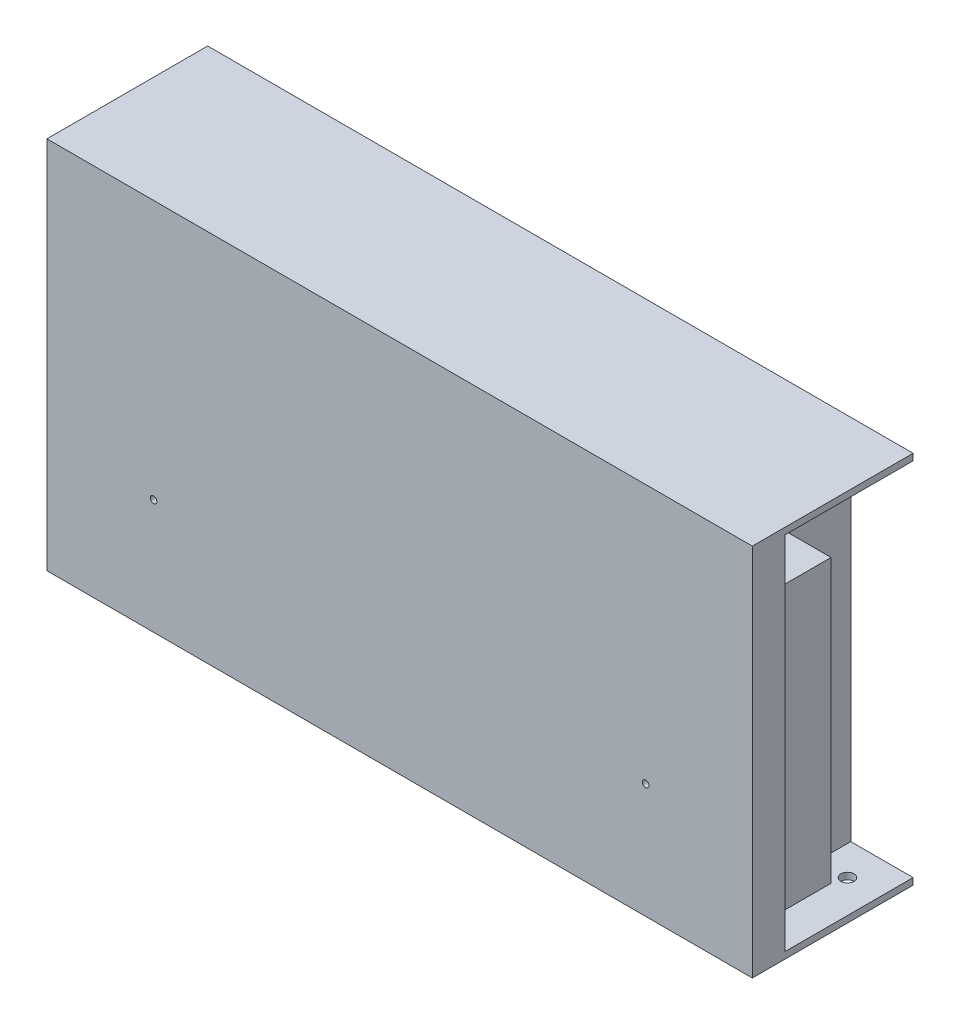
ISO-10303-21;
HEADER;
FILE_DESCRIPTION(('STEP AP214'),'2;1');
FILE_NAME('part.step','',(''),(''),'','','');
FILE_SCHEMA(('AUTOMOTIVE_DESIGN { 1 0 10303 214 1 1 1 1 }'));
ENDSEC;
DATA;
#1=APPLICATION_CONTEXT('core data for automotive mechanical design processes');
#2=APPLICATION_PROTOCOL_DEFINITION('international standard','automotive_design',2000,#1);
#3=PRODUCT_CONTEXT('',#1,'mechanical');
#4=PRODUCT('Part','Part','',(#3));
#5=PRODUCT_RELATED_PRODUCT_CATEGORY('part','',(#4));
#6=PRODUCT_DEFINITION_FORMATION('','',#4);
#7=PRODUCT_DEFINITION_CONTEXT('part definition',#1,'design');
#8=PRODUCT_DEFINITION('design','',#6,#7);
#9=PRODUCT_DEFINITION_SHAPE('','',#8);
#10=(LENGTH_UNIT() NAMED_UNIT(*) SI_UNIT(.MILLI.,.METRE.));
#11=(NAMED_UNIT(*) PLANE_ANGLE_UNIT() SI_UNIT($,.RADIAN.));
#12=(NAMED_UNIT(*) SI_UNIT($,.STERADIAN.) SOLID_ANGLE_UNIT());
#13=UNCERTAINTY_MEASURE_WITH_UNIT(LENGTH_MEASURE(1.E-05),#10,'distance_accuracy_value','');
#14=(GEOMETRIC_REPRESENTATION_CONTEXT(3) GLOBAL_UNCERTAINTY_ASSIGNED_CONTEXT((#13)) GLOBAL_UNIT_ASSIGNED_CONTEXT((#10,
#11,#12)) REPRESENTATION_CONTEXT('',''));
#15=CARTESIAN_POINT('',(0.,0.,0.));
#16=DIRECTION('',(0.,0.,1.));
#17=DIRECTION('',(1.,0.,0.));
#18=AXIS2_PLACEMENT_3D('',#15,#16,#17);
#19=CARTESIAN_POINT('',(88.5,55.,39.));
#20=DIRECTION('',(-1.,0.,0.));
#21=DIRECTION('',(0.,-1.,0.));
#22=AXIS2_PLACEMENT_3D('',#19,#20,#21);
#23=PLANE('',#22);
#24=DIRECTION('',(0.,0.,1.));
#25=VECTOR('',#24,1.);
#26=CARTESIAN_POINT('',(88.5,38.,21.));
#27=LINE('',#26,#25);
#28=CARTESIAN_POINT('',(88.5,38.,21.));
#29=VERTEX_POINT('',#28);
#30=CARTESIAN_POINT('',(88.5,38.,39.));
#31=VERTEX_POINT('',#30);
#32=EDGE_CURVE('E52',#29,#31,#27,.T.);
#33=ORIENTED_EDGE('',*,*,#32,.F.);
#34=DIRECTION('',(0.,1.,0.));
#35=VECTOR('',#34,1.);
#36=CARTESIAN_POINT('',(88.5,38.,21.));
#37=LINE('',#36,#35);
#38=CARTESIAN_POINT('',(88.5,-48.,21.));
#39=VERTEX_POINT('',#38);
#40=EDGE_CURVE('E57',#39,#29,#37,.T.);
#41=ORIENTED_EDGE('',*,*,#40,.F.);
#42=DIRECTION('',(0.,0.,1.));
#43=VECTOR('',#42,1.);
#44=CARTESIAN_POINT('',(88.5,-48.,21.));
#45=LINE('',#44,#43);
#46=CARTESIAN_POINT('',(88.5,-48.,39.));
#47=VERTEX_POINT('',#46);
#48=EDGE_CURVE('E147',#39,#47,#45,.T.);
#49=ORIENTED_EDGE('',*,*,#48,.T.);
#50=DIRECTION('',(0.,1.,0.));
#51=VECTOR('',#50,1.);
#52=CARTESIAN_POINT('',(88.5,55.,39.));
#53=LINE('',#52,#51);
#54=CARTESIAN_POINT('',(88.5,-55.,39.));
#55=VERTEX_POINT('',#54);
#56=EDGE_CURVE('E170',#55,#47,#53,.T.);
#57=ORIENTED_EDGE('',*,*,#56,.F.);
#58=DIRECTION('',(0.,0.,-1.));
#59=VECTOR('',#58,1.);
#60=CARTESIAN_POINT('',(88.5,-55.,39.));
#61=LINE('',#60,#59);
#62=CARTESIAN_POINT('',(88.5,-55.,0.));
#63=VERTEX_POINT('',#62);
#64=EDGE_CURVE('E188',#55,#63,#61,.T.);
#65=ORIENTED_EDGE('',*,*,#64,.T.);
#66=DIRECTION('',(0.,1.,0.));
#67=VECTOR('',#66,1.);
#68=CARTESIAN_POINT('',(88.5,55.,0.));
#69=LINE('',#68,#67);
#70=CARTESIAN_POINT('',(88.5,55.,0.));
#71=VERTEX_POINT('',#70);
#72=EDGE_CURVE('E178',#63,#71,#69,.T.);
#73=ORIENTED_EDGE('',*,*,#72,.T.);
#74=DIRECTION('',(0.,0.,-1.));
#75=VECTOR('',#74,1.);
#76=CARTESIAN_POINT('',(88.5,55.,39.));
#77=LINE('',#76,#75);
#78=CARTESIAN_POINT('',(88.5,55.,39.));
#79=VERTEX_POINT('',#78);
#80=EDGE_CURVE('E186',#79,#71,#77,.T.);
#81=ORIENTED_EDGE('',*,*,#80,.F.);
#82=EDGE_CURVE('E169',#31,#79,#53,.T.);
#83=ORIENTED_EDGE('',*,*,#82,.F.);
#84=EDGE_LOOP('',(#33,#41,#49,#57,#65,#73,#81,#83));
#85=FACE_BOUND('',#84,.T.);
#86=ADVANCED_FACE('F37',(#85),#23,.F.);
#87=CARTESIAN_POINT('',(0.,0.,39.));
#88=DIRECTION('',(0.,0.,1.));
#89=DIRECTION('',(1.,0.,0.));
#90=AXIS2_PLACEMENT_3D('',#87,#88,#89);
#91=PLANE('',#90);
#92=DIRECTION('',(1.,0.,0.));
#93=VECTOR('',#92,1.);
#94=CARTESIAN_POINT('',(103.5,38.,39.));
#95=LINE('',#94,#93);
#96=CARTESIAN_POINT('',(103.5,38.,39.));
#97=VERTEX_POINT('',#96);
#98=EDGE_CURVE('E137',#31,#97,#95,.T.);
#99=ORIENTED_EDGE('',*,*,#98,.F.);
#100=ORIENTED_EDGE('',*,*,#82,.T.);
#101=DIRECTION('',(1.,0.,0.));
#102=VECTOR('',#101,1.);
#103=CARTESIAN_POINT('',(107.5,55.,39.));
#104=LINE('',#103,#102);
#105=CARTESIAN_POINT('',(107.5,55.,39.));
#106=VERTEX_POINT('',#105);
#107=EDGE_CURVE('E172',#79,#106,#104,.T.);
#108=ORIENTED_EDGE('',*,*,#107,.T.);
#109=DIRECTION('',(0.,-1.,0.));
#110=VECTOR('',#109,1.);
#111=CARTESIAN_POINT('',(107.5,-55.,39.));
#112=LINE('',#111,#110);
#113=CARTESIAN_POINT('',(107.5,-55.,39.));
#114=VERTEX_POINT('',#113);
#115=EDGE_CURVE('E162',#106,#114,#112,.T.);
#116=ORIENTED_EDGE('',*,*,#115,.T.);
#117=DIRECTION('',(-1.,0.,0.));
#118=VECTOR('',#117,1.);
#119=CARTESIAN_POINT('',(88.5,-55.,39.));
#120=LINE('',#119,#118);
#121=EDGE_CURVE('E165',#114,#55,#120,.T.);
#122=ORIENTED_EDGE('',*,*,#121,.T.);
#123=ORIENTED_EDGE('',*,*,#56,.T.);
#124=DIRECTION('',(-1.,0.,0.));
#125=VECTOR('',#124,1.);
#126=CARTESIAN_POINT('',(88.5,-48.,39.));
#127=LINE('',#126,#125);
#128=CARTESIAN_POINT('',(103.5,-48.,39.));
#129=VERTEX_POINT('',#128);
#130=EDGE_CURVE('E155',#129,#47,#127,.T.);
#131=ORIENTED_EDGE('',*,*,#130,.F.);
#132=DIRECTION('',(0.,-1.,0.));
#133=VECTOR('',#132,1.);
#134=CARTESIAN_POINT('',(103.5,-48.,39.));
#135=LINE('',#134,#133);
#136=EDGE_CURVE('E152',#97,#129,#135,.T.);
#137=ORIENTED_EDGE('',*,*,#136,.F.);
#138=EDGE_LOOP('',(#99,#100,#108,#116,#122,#123,#131,#137));
#139=FACE_BOUND('',#138,.T.);
#140=ADVANCED_FACE('F248',(#139),#91,.F.);
#141=CARTESIAN_POINT('',(107.5,-57.,49.));
#142=DIRECTION('',(-1.,0.,0.));
#143=DIRECTION('',(0.,0.,1.));
#144=AXIS2_PLACEMENT_3D('',#141,#142,#143);
#145=PLANE('',#144);
#146=ORIENTED_EDGE('',*,*,#115,.F.);
#147=DIRECTION('',(0.,0.,-1.));
#148=VECTOR('',#147,1.);
#149=CARTESIAN_POINT('',(107.5,55.,39.));
#150=LINE('',#149,#148);
#151=CARTESIAN_POINT('',(107.5,55.,0.));
#152=VERTEX_POINT('',#151);
#153=EDGE_CURVE('E182',#106,#152,#150,.T.);
#154=ORIENTED_EDGE('',*,*,#153,.T.);
#155=DIRECTION('',(0.,1.,0.));
#156=VECTOR('',#155,1.);
#157=CARTESIAN_POINT('',(107.5,-57.,0.));
#158=LINE('',#157,#156);
#159=CARTESIAN_POINT('',(107.5,57.,0.));
#160=VERTEX_POINT('',#159);
#161=EDGE_CURVE('E185',#152,#160,#158,.T.);
#162=ORIENTED_EDGE('',*,*,#161,.T.);
#163=DIRECTION('',(0.,0.,-1.));
#164=VECTOR('',#163,1.);
#165=CARTESIAN_POINT('',(107.5,57.,49.));
#166=LINE('',#165,#164);
#167=CARTESIAN_POINT('',(107.5,57.,49.));
#168=VERTEX_POINT('',#167);
#169=EDGE_CURVE('E11',#168,#160,#166,.T.);
#170=ORIENTED_EDGE('',*,*,#169,.F.);
#171=DIRECTION('',(0.,1.,0.));
#172=VECTOR('',#171,1.);
#173=CARTESIAN_POINT('',(107.5,-57.,49.));
#174=LINE('',#173,#172);
#175=CARTESIAN_POINT('',(107.5,-57.,49.));
#176=VERTEX_POINT('',#175);
#177=EDGE_CURVE('E191',#176,#168,#174,.T.);
#178=ORIENTED_EDGE('',*,*,#177,.F.);
#179=DIRECTION('',(0.,0.,-1.));
#180=VECTOR('',#179,1.);
#181=CARTESIAN_POINT('',(107.5,-57.,49.));
#182=LINE('',#181,#180);
#183=CARTESIAN_POINT('',(107.5,-57.,0.));
#184=VERTEX_POINT('',#183);
#185=EDGE_CURVE('E201',#176,#184,#182,.T.);
#186=ORIENTED_EDGE('',*,*,#185,.T.);
#187=CARTESIAN_POINT('',(107.5,-55.,0.));
#188=VERTEX_POINT('',#187);
#189=EDGE_CURVE('E202',#184,#188,#158,.T.);
#190=ORIENTED_EDGE('',*,*,#189,.T.);
#191=DIRECTION('',(0.,0.,-1.));
#192=VECTOR('',#191,1.);
#193=CARTESIAN_POINT('',(107.5,-55.,39.));
#194=LINE('',#193,#192);
#195=EDGE_CURVE('E175',#114,#188,#194,.T.);
#196=ORIENTED_EDGE('',*,*,#195,.F.);
#197=EDGE_LOOP('',(#146,#154,#162,#170,#178,#186,#190,#196));
#198=FACE_BOUND('',#197,.T.);
#199=ADVANCED_FACE('F39',(#198),#145,.F.);
#200=CARTESIAN_POINT('',(-107.5,57.,49.));
#201=DIRECTION('',(0.,-1.,0.));
#202=DIRECTION('',(0.,0.,-1.));
#203=AXIS2_PLACEMENT_3D('',#200,#201,#202);
#204=PLANE('',#203);
#205=DIRECTION('',(-1.,0.,0.));
#206=VECTOR('',#205,1.);
#207=CARTESIAN_POINT('',(-107.5,57.,0.));
#208=LINE('',#207,#206);
#209=CARTESIAN_POINT('',(-107.5,57.,0.));
#210=VERTEX_POINT('',#209);
#211=EDGE_CURVE('E205',#160,#210,#208,.T.);
#212=ORIENTED_EDGE('',*,*,#211,.T.);
#213=DIRECTION('',(0.,0.,-1.));
#214=VECTOR('',#213,1.);
#215=CARTESIAN_POINT('',(-107.5,57.,49.));
#216=LINE('',#215,#214);
#217=CARTESIAN_POINT('',(-107.5,57.,49.));
#218=VERTEX_POINT('',#217);
#219=EDGE_CURVE('E45',#218,#210,#216,.T.);
#220=ORIENTED_EDGE('',*,*,#219,.F.);
#221=DIRECTION('',(-1.,0.,0.));
#222=VECTOR('',#221,1.);
#223=CARTESIAN_POINT('',(-107.5,57.,49.));
#224=LINE('',#223,#222);
#225=EDGE_CURVE('E194',#168,#218,#224,.T.);
#226=ORIENTED_EDGE('',*,*,#225,.F.);
#227=ORIENTED_EDGE('',*,*,#169,.T.);
#228=EDGE_LOOP('',(#212,#220,#226,#227));
#229=FACE_BOUND('',#228,.T.);
#230=ADVANCED_FACE('F241',(#229),#204,.F.);
#231=CARTESIAN_POINT('',(-107.5,-57.,49.));
#232=DIRECTION('',(1.,0.,0.));
#233=DIRECTION('',(0.,0.,-1.));
#234=AXIS2_PLACEMENT_3D('',#231,#232,#233);
#235=PLANE('',#234);
#236=DIRECTION('',(0.,-1.,0.));
#237=VECTOR('',#236,1.);
#238=CARTESIAN_POINT('',(-107.5,-57.,0.));
#239=LINE('',#238,#237);
#240=CARTESIAN_POINT('',(-107.5,-57.,0.));
#241=VERTEX_POINT('',#240);
#242=EDGE_CURVE('E207',#210,#241,#239,.T.);
#243=ORIENTED_EDGE('',*,*,#242,.T.);
#244=DIRECTION('',(0.,0.,-1.));
#245=VECTOR('',#244,1.);
#246=CARTESIAN_POINT('',(-107.5,-57.,49.));
#247=LINE('',#246,#245);
#248=CARTESIAN_POINT('',(-107.5,-57.,49.));
#249=VERTEX_POINT('',#248);
#250=EDGE_CURVE('E212',#249,#241,#247,.T.);
#251=ORIENTED_EDGE('',*,*,#250,.F.);
#252=DIRECTION('',(0.,-1.,0.));
#253=VECTOR('',#252,1.);
#254=CARTESIAN_POINT('',(-107.5,-57.,49.));
#255=LINE('',#254,#253);
#256=EDGE_CURVE('E197',#218,#249,#255,.T.);
#257=ORIENTED_EDGE('',*,*,#256,.F.);
#258=ORIENTED_EDGE('',*,*,#219,.T.);
#259=EDGE_LOOP('',(#243,#251,#257,#258));
#260=FACE_BOUND('',#259,.T.);
#261=ADVANCED_FACE('F219',(#260),#235,.F.);
#262=CARTESIAN_POINT('',(-107.5,-57.,49.));
#263=DIRECTION('',(0.,1.,0.));
#264=DIRECTION('',(0.,0.,1.));
#265=AXIS2_PLACEMENT_3D('',#262,#263,#264);
#266=PLANE('',#265);
#267=CARTESIAN_POINT('',(97.5,-57.,10.));
#268=DIRECTION('',(0.,1.,0.));
#269=DIRECTION('',(0.,0.,1.));
#270=AXIS2_PLACEMENT_3D('',#267,#268,#269);
#271=CIRCLE('',#270,2.);
#272=CARTESIAN_POINT('',(97.5,-57.,12.));
#273=VERTEX_POINT('',#272);
#274=EDGE_CURVE('E153',#273,#273,#271,.T.);
#275=ORIENTED_EDGE('',*,*,#274,.T.);
#276=EDGE_LOOP('',(#275));
#277=FACE_BOUND('',#276,.T.);
#278=DIRECTION('',(1.,0.,0.));
#279=VECTOR('',#278,1.);
#280=CARTESIAN_POINT('',(-107.5,-57.,0.));
#281=LINE('',#280,#279);
#282=EDGE_CURVE('E195',#241,#184,#281,.T.);
#283=ORIENTED_EDGE('',*,*,#282,.T.);
#284=ORIENTED_EDGE('',*,*,#185,.F.);
#285=DIRECTION('',(1.,0.,0.));
#286=VECTOR('',#285,1.);
#287=CARTESIAN_POINT('',(-107.5,-57.,49.));
#288=LINE('',#287,#286);
#289=EDGE_CURVE('E199',#249,#176,#288,.T.);
#290=ORIENTED_EDGE('',*,*,#289,.F.);
#291=ORIENTED_EDGE('',*,*,#250,.T.);
#292=EDGE_LOOP('',(#283,#284,#290,#291));
#293=FACE_BOUND('',#292,.T.);
#294=ADVANCED_FACE('F232',(#277,#293),#266,.F.);
#295=CARTESIAN_POINT('',(0.,0.,49.));
#296=DIRECTION('',(0.,0.,-1.));
#297=DIRECTION('',(-1.,0.,0.));
#298=AXIS2_PLACEMENT_3D('',#295,#296,#297);
#299=PLANE('',#298);
#300=CARTESIAN_POINT('',(75.,-22.,49.));
#301=DIRECTION('',(0.,0.,1.));
#302=DIRECTION('',(1.,0.,0.));
#303=AXIS2_PLACEMENT_3D('',#300,#301,#302);
#304=CIRCLE('',#303,0.999999999999998);
#305=CARTESIAN_POINT('',(76.,-22.,49.));
#306=VERTEX_POINT('',#305);
#307=EDGE_CURVE('E288',#306,#306,#304,.T.);
#308=ORIENTED_EDGE('',*,*,#307,.F.);
#309=EDGE_LOOP('',(#308));
#310=FACE_BOUND('',#309,.T.);
#311=CARTESIAN_POINT('',(-75.,-22.,49.));
#312=DIRECTION('',(0.,0.,1.));
#313=DIRECTION('',(1.,0.,0.));
#314=AXIS2_PLACEMENT_3D('',#311,#312,#313);
#315=CIRCLE('',#314,0.999999999999998);
#316=CARTESIAN_POINT('',(-74.,-22.,49.));
#317=VERTEX_POINT('',#316);
#318=EDGE_CURVE('E282',#317,#317,#315,.T.);
#319=ORIENTED_EDGE('',*,*,#318,.F.);
#320=EDGE_LOOP('',(#319));
#321=FACE_BOUND('',#320,.T.);
#322=ORIENTED_EDGE('',*,*,#177,.T.);
#323=ORIENTED_EDGE('',*,*,#225,.T.);
#324=ORIENTED_EDGE('',*,*,#256,.T.);
#325=ORIENTED_EDGE('',*,*,#289,.T.);
#326=EDGE_LOOP('',(#322,#323,#324,#325));
#327=FACE_BOUND('',#326,.T.);
#328=ADVANCED_FACE('F240',(#310,#321,#327),#299,.F.);
#329=CARTESIAN_POINT('',(0.,0.,0.));
#330=DIRECTION('',(0.,0.,-1.));
#331=DIRECTION('',(-1.,0.,0.));
#332=AXIS2_PLACEMENT_3D('',#329,#330,#331);
#333=PLANE('',#332);
#334=DIRECTION('',(1.,0.,0.));
#335=VECTOR('',#334,1.);
#336=CARTESIAN_POINT('',(107.5,55.,0.));
#337=LINE('',#336,#335);
#338=EDGE_CURVE('E166',#71,#152,#337,.T.);
#339=ORIENTED_EDGE('',*,*,#338,.F.);
#340=ORIENTED_EDGE('',*,*,#72,.F.);
#341=DIRECTION('',(-1.,0.,0.));
#342=VECTOR('',#341,1.);
#343=CARTESIAN_POINT('',(88.5,-55.,0.));
#344=LINE('',#343,#342);
#345=EDGE_CURVE('E161',#188,#63,#344,.T.);
#346=ORIENTED_EDGE('',*,*,#345,.F.);
#347=ORIENTED_EDGE('',*,*,#189,.F.);
#348=ORIENTED_EDGE('',*,*,#282,.F.);
#349=ORIENTED_EDGE('',*,*,#242,.F.);
#350=ORIENTED_EDGE('',*,*,#211,.F.);
#351=ORIENTED_EDGE('',*,*,#161,.F.);
#352=EDGE_LOOP('',(#339,#340,#346,#347,#348,#349,#350,#351));
#353=FACE_BOUND('',#352,.T.);
#354=ADVANCED_FACE('F226',(#353),#333,.T.);
#355=CARTESIAN_POINT('',(107.5,55.,39.));
#356=DIRECTION('',(0.,1.,0.));
#357=DIRECTION('',(0.,0.,1.));
#358=AXIS2_PLACEMENT_3D('',#355,#356,#357);
#359=PLANE('',#358);
#360=ORIENTED_EDGE('',*,*,#338,.T.);
#361=ORIENTED_EDGE('',*,*,#153,.F.);
#362=ORIENTED_EDGE('',*,*,#107,.F.);
#363=ORIENTED_EDGE('',*,*,#80,.T.);
#364=EDGE_LOOP('',(#360,#361,#362,#363));
#365=FACE_BOUND('',#364,.T.);
#366=ADVANCED_FACE('F258',(#365),#359,.F.);
#367=CARTESIAN_POINT('',(88.5,-55.,39.));
#368=DIRECTION('',(0.,-1.,0.));
#369=DIRECTION('',(0.,0.,-1.));
#370=AXIS2_PLACEMENT_3D('',#367,#368,#369);
#371=PLANE('',#370);
#372=CARTESIAN_POINT('',(97.5,-55.,10.));
#373=DIRECTION('',(0.,1.,0.));
#374=DIRECTION('',(0.,0.,1.));
#375=AXIS2_PLACEMENT_3D('',#372,#373,#374);
#376=CIRCLE('',#375,2.);
#377=CARTESIAN_POINT('',(97.5,-55.,12.));
#378=VERTEX_POINT('',#377);
#379=EDGE_CURVE('E276',#378,#378,#376,.T.);
#380=ORIENTED_EDGE('',*,*,#379,.F.);
#381=EDGE_LOOP('',(#380));
#382=FACE_BOUND('',#381,.T.);
#383=ORIENTED_EDGE('',*,*,#345,.T.);
#384=ORIENTED_EDGE('',*,*,#64,.F.);
#385=ORIENTED_EDGE('',*,*,#121,.F.);
#386=ORIENTED_EDGE('',*,*,#195,.T.);
#387=EDGE_LOOP('',(#383,#384,#385,#386));
#388=FACE_BOUND('',#387,.T.);
#389=ADVANCED_FACE('F259',(#382,#388),#371,.F.);
#390=CARTESIAN_POINT('',(103.5,38.,21.));
#391=DIRECTION('',(0.,-1.,0.));
#392=DIRECTION('',(0.,0.,-1.));
#393=AXIS2_PLACEMENT_3D('',#390,#391,#392);
#394=PLANE('',#393);
#395=ORIENTED_EDGE('',*,*,#98,.T.);
#396=DIRECTION('',(0.,0.,1.));
#397=VECTOR('',#396,1.);
#398=CARTESIAN_POINT('',(103.5,38.,21.));
#399=LINE('',#398,#397);
#400=CARTESIAN_POINT('',(103.5,38.,21.));
#401=VERTEX_POINT('',#400);
#402=EDGE_CURVE('E135',#401,#97,#399,.T.);
#403=ORIENTED_EDGE('',*,*,#402,.F.);
#404=DIRECTION('',(1.,0.,0.));
#405=VECTOR('',#404,1.);
#406=CARTESIAN_POINT('',(103.5,38.,21.));
#407=LINE('',#406,#405);
#408=EDGE_CURVE('E125',#29,#401,#407,.T.);
#409=ORIENTED_EDGE('',*,*,#408,.F.);
#410=ORIENTED_EDGE('',*,*,#32,.T.);
#411=EDGE_LOOP('',(#395,#403,#409,#410));
#412=FACE_BOUND('',#411,.T.);
#413=ADVANCED_FACE('F136',(#412),#394,.F.);
#414=CARTESIAN_POINT('',(103.5,-48.,21.));
#415=DIRECTION('',(-1.,0.,0.));
#416=DIRECTION('',(0.,-1.,0.));
#417=AXIS2_PLACEMENT_3D('',#414,#415,#416);
#418=PLANE('',#417);
#419=ORIENTED_EDGE('',*,*,#136,.T.);
#420=DIRECTION('',(0.,0.,1.));
#421=VECTOR('',#420,1.);
#422=CARTESIAN_POINT('',(103.5,-48.,21.));
#423=LINE('',#422,#421);
#424=CARTESIAN_POINT('',(103.5,-48.,21.));
#425=VERTEX_POINT('',#424);
#426=EDGE_CURVE('E140',#425,#129,#423,.T.);
#427=ORIENTED_EDGE('',*,*,#426,.F.);
#428=DIRECTION('',(0.,-1.,0.));
#429=VECTOR('',#428,1.);
#430=CARTESIAN_POINT('',(103.5,-48.,21.));
#431=LINE('',#430,#429);
#432=EDGE_CURVE('E129',#401,#425,#431,.T.);
#433=ORIENTED_EDGE('',*,*,#432,.F.);
#434=ORIENTED_EDGE('',*,*,#402,.T.);
#435=EDGE_LOOP('',(#419,#427,#433,#434));
#436=FACE_BOUND('',#435,.T.);
#437=ADVANCED_FACE('F142',(#436),#418,.F.);
#438=CARTESIAN_POINT('',(88.5,-48.,21.));
#439=DIRECTION('',(0.,1.,0.));
#440=DIRECTION('',(0.,0.,1.));
#441=AXIS2_PLACEMENT_3D('',#438,#439,#440);
#442=PLANE('',#441);
#443=ORIENTED_EDGE('',*,*,#130,.T.);
#444=ORIENTED_EDGE('',*,*,#48,.F.);
#445=DIRECTION('',(-1.,0.,0.));
#446=VECTOR('',#445,1.);
#447=CARTESIAN_POINT('',(88.5,-48.,21.));
#448=LINE('',#447,#446);
#449=EDGE_CURVE('E145',#425,#39,#448,.T.);
#450=ORIENTED_EDGE('',*,*,#449,.F.);
#451=ORIENTED_EDGE('',*,*,#426,.T.);
#452=EDGE_LOOP('',(#443,#444,#450,#451));
#453=FACE_BOUND('',#452,.T.);
#454=ADVANCED_FACE('F322',(#453),#442,.F.);
#455=CARTESIAN_POINT('',(0.,0.,21.));
#456=DIRECTION('',(0.,0.,1.));
#457=DIRECTION('',(1.,0.,0.));
#458=AXIS2_PLACEMENT_3D('',#455,#456,#457);
#459=PLANE('',#458);
#460=ORIENTED_EDGE('',*,*,#40,.T.);
#461=ORIENTED_EDGE('',*,*,#408,.T.);
#462=ORIENTED_EDGE('',*,*,#432,.T.);
#463=ORIENTED_EDGE('',*,*,#449,.T.);
#464=EDGE_LOOP('',(#460,#461,#462,#463));
#465=FACE_BOUND('',#464,.T.);
#466=ADVANCED_FACE('F127',(#465),#459,.F.);
#467=CARTESIAN_POINT('',(97.5,-63.,10.));
#468=DIRECTION('',(0.,1.,0.));
#469=DIRECTION('',(0.,0.,1.));
#470=AXIS2_PLACEMENT_3D('',#467,#468,#469);
#471=CYLINDRICAL_SURFACE('',#470,2.);
#472=ORIENTED_EDGE('',*,*,#379,.T.);
#473=EDGE_LOOP('',(#472));
#474=FACE_BOUND('',#473,.T.);
#475=ORIENTED_EDGE('',*,*,#274,.F.);
#476=EDGE_LOOP('',(#475));
#477=FACE_BOUND('',#476,.T.);
#478=ADVANCED_FACE('F307',(#474,#477),#471,.F.);
#479=CARTESIAN_POINT('',(-75.,-22.,47.));
#480=DIRECTION('',(0.,0.,1.));
#481=DIRECTION('',(1.,0.,0.));
#482=AXIS2_PLACEMENT_3D('',#479,#480,#481);
#483=CYLINDRICAL_SURFACE('',#482,0.999999999999998);
#484=CARTESIAN_POINT('',(-75.,-22.,47.));
#485=DIRECTION('',(0.,0.,1.));
#486=DIRECTION('',(1.,0.,0.));
#487=AXIS2_PLACEMENT_3D('',#484,#485,#486);
#488=CIRCLE('',#487,0.999999999999998);
#489=CARTESIAN_POINT('',(-74.,-22.,47.));
#490=VERTEX_POINT('',#489);
#491=EDGE_CURVE('E285',#490,#490,#488,.T.);
#492=ORIENTED_EDGE('',*,*,#491,.F.);
#493=EDGE_LOOP('',(#492));
#494=FACE_BOUND('',#493,.T.);
#495=ORIENTED_EDGE('',*,*,#318,.T.);
#496=EDGE_LOOP('',(#495));
#497=FACE_BOUND('',#496,.T.);
#498=ADVANCED_FACE('F305',(#494,#497),#483,.F.);
#499=CARTESIAN_POINT('',(-75.,-22.,47.));
#500=DIRECTION('',(0.,0.,1.));
#501=DIRECTION('',(1.,0.,0.));
#502=AXIS2_PLACEMENT_3D('',#499,#500,#501);
#503=PLANE('',#502);
#504=ORIENTED_EDGE('',*,*,#491,.T.);
#505=EDGE_LOOP('',(#504));
#506=FACE_BOUND('',#505,.T.);
#507=ADVANCED_FACE('F299',(#506),#503,.T.);
#508=CARTESIAN_POINT('',(75.,-22.,47.));
#509=DIRECTION('',(0.,0.,1.));
#510=DIRECTION('',(1.,0.,0.));
#511=AXIS2_PLACEMENT_3D('',#508,#509,#510);
#512=CYLINDRICAL_SURFACE('',#511,0.999999999999998);
#513=CARTESIAN_POINT('',(75.,-22.,47.));
#514=DIRECTION('',(0.,0.,1.));
#515=DIRECTION('',(1.,0.,0.));
#516=AXIS2_PLACEMENT_3D('',#513,#514,#515);
#517=CIRCLE('',#516,0.999999999999998);
#518=CARTESIAN_POINT('',(76.,-22.,47.));
#519=VERTEX_POINT('',#518);
#520=EDGE_CURVE('E279',#519,#519,#517,.T.);
#521=ORIENTED_EDGE('',*,*,#520,.F.);
#522=EDGE_LOOP('',(#521));
#523=FACE_BOUND('',#522,.T.);
#524=ORIENTED_EDGE('',*,*,#307,.T.);
#525=EDGE_LOOP('',(#524));
#526=FACE_BOUND('',#525,.T.);
#527=ADVANCED_FACE('F296',(#523,#526),#512,.F.);
#528=CARTESIAN_POINT('',(75.,-22.,47.));
#529=DIRECTION('',(0.,0.,1.));
#530=DIRECTION('',(1.,0.,0.));
#531=AXIS2_PLACEMENT_3D('',#528,#529,#530);
#532=PLANE('',#531);
#533=ORIENTED_EDGE('',*,*,#520,.T.);
#534=EDGE_LOOP('',(#533));
#535=FACE_BOUND('',#534,.T.);
#536=ADVANCED_FACE('F294',(#535),#532,.T.);
#537=CLOSED_SHELL('',(#86,#140,#199,#230,#261,#294,#328,#354,#366,#389,#413,#437,#454,#466,#478,
#498,#507,#527,#536));
#538=MANIFOLD_SOLID_BREP('B2',#537);
#539=ADVANCED_BREP_SHAPE_REPRESENTATION('',(#18,#538),#14);
#540=SHAPE_DEFINITION_REPRESENTATION(#9,#539);
ENDSEC;
END-ISO-10303-21;
